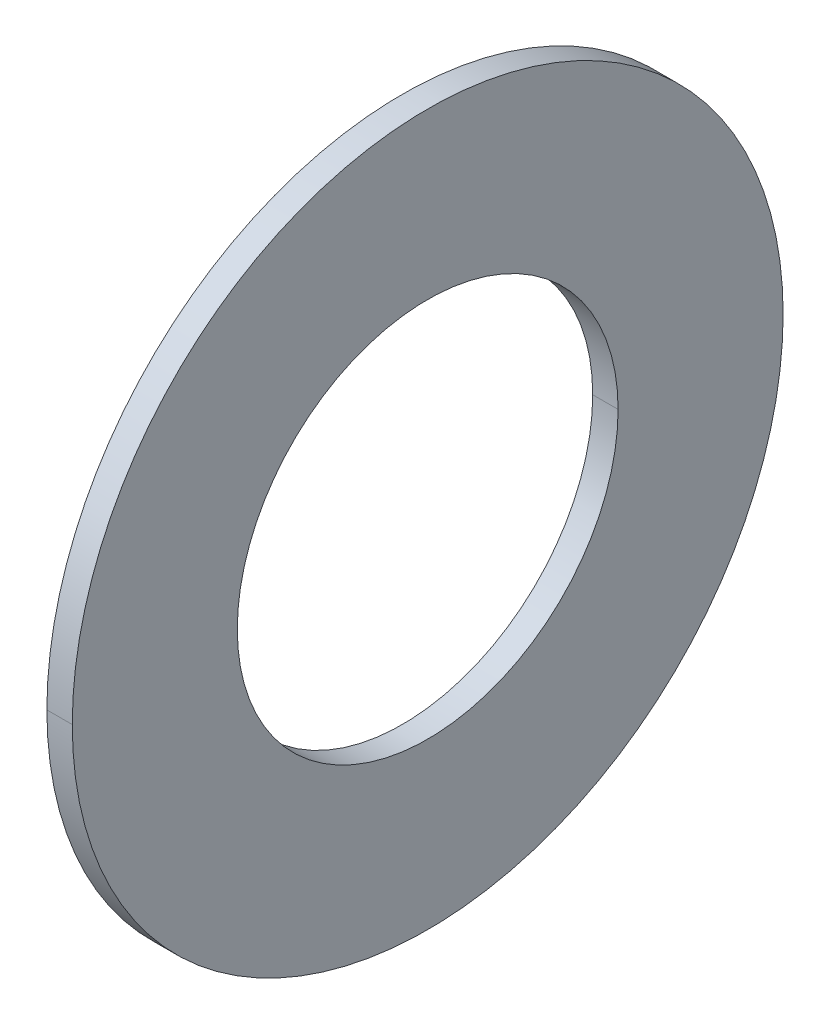
ISO-10303-21;
HEADER;
FILE_DESCRIPTION(('STEP AP214'),'2;1');
FILE_NAME('part.step','',(''),(''),'','','');
FILE_SCHEMA(('AUTOMOTIVE_DESIGN { 1 0 10303 214 1 1 1 1 }'));
ENDSEC;
DATA;
#1=APPLICATION_CONTEXT('core data for automotive mechanical design processes');
#2=APPLICATION_PROTOCOL_DEFINITION('international standard','automotive_design',2000,#1);
#3=PRODUCT_CONTEXT('',#1,'mechanical');
#4=PRODUCT('Part','Part','',(#3));
#5=PRODUCT_RELATED_PRODUCT_CATEGORY('part','',(#4));
#6=PRODUCT_DEFINITION_FORMATION('','',#4);
#7=PRODUCT_DEFINITION_CONTEXT('part definition',#1,'design');
#8=PRODUCT_DEFINITION('design','',#6,#7);
#9=PRODUCT_DEFINITION_SHAPE('','',#8);
#10=(LENGTH_UNIT() NAMED_UNIT(*) SI_UNIT(.MILLI.,.METRE.));
#11=(NAMED_UNIT(*) PLANE_ANGLE_UNIT() SI_UNIT($,.RADIAN.));
#12=(NAMED_UNIT(*) SI_UNIT($,.STERADIAN.) SOLID_ANGLE_UNIT());
#13=UNCERTAINTY_MEASURE_WITH_UNIT(LENGTH_MEASURE(1.E-05),#10,'distance_accuracy_value','');
#14=(GEOMETRIC_REPRESENTATION_CONTEXT(3) GLOBAL_UNCERTAINTY_ASSIGNED_CONTEXT((#13)) GLOBAL_UNIT_ASSIGNED_CONTEXT((#10,
#11,#12)) REPRESENTATION_CONTEXT('',''));
#15=CARTESIAN_POINT('',(0.,0.,0.));
#16=DIRECTION('',(0.,0.,1.));
#17=DIRECTION('',(1.,0.,0.));
#18=AXIS2_PLACEMENT_3D('',#15,#16,#17);
#19=CARTESIAN_POINT('',(1.,14.,0.));
#20=DIRECTION('',(-1.,0.,0.));
#21=DIRECTION('',(0.,0.,1.));
#22=AXIS2_PLACEMENT_3D('',#19,#20,#21);
#23=PLANE('',#22);
#24=CARTESIAN_POINT('',(1.,0.,0.));
#25=DIRECTION('',(1.,0.,0.));
#26=DIRECTION('',(0.,0.,-1.));
#27=AXIS2_PLACEMENT_3D('',#24,#25,#26);
#28=CIRCLE('',#27,7.5);
#29=CARTESIAN_POINT('',(1.,0.,-7.5));
#30=VERTEX_POINT('',#29);
#31=CARTESIAN_POINT('',(1.,0.,7.5));
#32=VERTEX_POINT('',#31);
#33=EDGE_CURVE('E11',#30,#32,#28,.T.);
#34=ORIENTED_EDGE('',*,*,#33,.T.);
#35=CARTESIAN_POINT('',(1.,0.,0.));
#36=DIRECTION('',(1.,0.,0.));
#37=DIRECTION('',(0.,0.,-1.));
#38=AXIS2_PLACEMENT_3D('',#35,#36,#37);
#39=CIRCLE('',#38,7.5);
#40=EDGE_CURVE('E24',#32,#30,#39,.T.);
#41=ORIENTED_EDGE('',*,*,#40,.T.);
#42=EDGE_LOOP('',(#34,#41));
#43=FACE_BOUND('',#42,.T.);
#44=CARTESIAN_POINT('',(1.,0.,0.));
#45=DIRECTION('',(1.,0.,0.));
#46=DIRECTION('',(0.,0.,-1.));
#47=AXIS2_PLACEMENT_3D('',#44,#45,#46);
#48=CIRCLE('',#47,14.);
#49=CARTESIAN_POINT('',(1.,0.,14.));
#50=VERTEX_POINT('',#49);
#51=CARTESIAN_POINT('',(1.,0.,-14.));
#52=VERTEX_POINT('',#51);
#53=EDGE_CURVE('E94',#50,#52,#48,.T.);
#54=ORIENTED_EDGE('',*,*,#53,.F.);
#55=CARTESIAN_POINT('',(1.,0.,0.));
#56=DIRECTION('',(1.,0.,0.));
#57=DIRECTION('',(0.,0.,-1.));
#58=AXIS2_PLACEMENT_3D('',#55,#56,#57);
#59=CIRCLE('',#58,14.);
#60=EDGE_CURVE('E89',#52,#50,#59,.T.);
#61=ORIENTED_EDGE('',*,*,#60,.F.);
#62=EDGE_LOOP('',(#54,#61));
#63=FACE_BOUND('',#62,.T.);
#64=ADVANCED_FACE('F16',(#43,#63),#23,.T.);
#65=CARTESIAN_POINT('',(50.,0.,0.));
#66=DIRECTION('',(1.,0.,0.));
#67=DIRECTION('',(0.,-1.,0.));
#68=AXIS2_PLACEMENT_3D('',#65,#66,#67);
#69=CYLINDRICAL_SURFACE('',#68,14.);
#70=DIRECTION('',(1.,0.,0.));
#71=VECTOR('',#70,1.);
#72=CARTESIAN_POINT('',(1.,0.,14.));
#73=LINE('',#72,#71);
#74=CARTESIAN_POINT('',(2.,0.,14.));
#75=VERTEX_POINT('',#74);
#76=EDGE_CURVE('E85',#50,#75,#73,.T.);
#77=ORIENTED_EDGE('',*,*,#76,.T.);
#78=CARTESIAN_POINT('',(2.,0.,0.));
#79=DIRECTION('',(1.,0.,0.));
#80=DIRECTION('',(0.,0.,-1.));
#81=AXIS2_PLACEMENT_3D('',#78,#79,#80);
#82=CIRCLE('',#81,14.);
#83=CARTESIAN_POINT('',(2.,0.,-14.));
#84=VERTEX_POINT('',#83);
#85=EDGE_CURVE('E80',#84,#75,#82,.T.);
#86=ORIENTED_EDGE('',*,*,#85,.F.);
#87=DIRECTION('',(1.,0.,0.));
#88=VECTOR('',#87,1.);
#89=CARTESIAN_POINT('',(1.,0.,-14.));
#90=LINE('',#89,#88);
#91=EDGE_CURVE('E69',#52,#84,#90,.T.);
#92=ORIENTED_EDGE('',*,*,#91,.F.);
#93=ORIENTED_EDGE('',*,*,#60,.T.);
#94=EDGE_LOOP('',(#77,#86,#92,#93));
#95=FACE_BOUND('',#94,.T.);
#96=ADVANCED_FACE('F110',(#95),#69,.T.);
#97=CARTESIAN_POINT('',(50.,0.,0.));
#98=DIRECTION('',(1.,0.,0.));
#99=DIRECTION('',(0.,1.,0.));
#100=AXIS2_PLACEMENT_3D('',#97,#98,#99);
#101=CYLINDRICAL_SURFACE('',#100,14.);
#102=ORIENTED_EDGE('',*,*,#76,.F.);
#103=ORIENTED_EDGE('',*,*,#53,.T.);
#104=ORIENTED_EDGE('',*,*,#91,.T.);
#105=CARTESIAN_POINT('',(2.,0.,0.));
#106=DIRECTION('',(1.,0.,0.));
#107=DIRECTION('',(0.,0.,-1.));
#108=AXIS2_PLACEMENT_3D('',#105,#106,#107);
#109=CIRCLE('',#108,14.);
#110=EDGE_CURVE('E66',#75,#84,#109,.T.);
#111=ORIENTED_EDGE('',*,*,#110,.F.);
#112=EDGE_LOOP('',(#102,#103,#104,#111));
#113=FACE_BOUND('',#112,.T.);
#114=ADVANCED_FACE('F105',(#113),#101,.T.);
#115=CARTESIAN_POINT('',(2.,7.5,0.));
#116=DIRECTION('',(1.,0.,0.));
#117=DIRECTION('',(0.,0.,-1.));
#118=AXIS2_PLACEMENT_3D('',#115,#116,#117);
#119=PLANE('',#118);
#120=ORIENTED_EDGE('',*,*,#85,.T.);
#121=ORIENTED_EDGE('',*,*,#110,.T.);
#122=EDGE_LOOP('',(#120,#121));
#123=FACE_BOUND('',#122,.T.);
#124=CARTESIAN_POINT('',(2.,0.,0.));
#125=DIRECTION('',(1.,0.,0.));
#126=DIRECTION('',(0.,0.,-1.));
#127=AXIS2_PLACEMENT_3D('',#124,#125,#126);
#128=CIRCLE('',#127,7.5);
#129=CARTESIAN_POINT('',(2.,0.,7.5));
#130=VERTEX_POINT('',#129);
#131=CARTESIAN_POINT('',(2.,0.,-7.5));
#132=VERTEX_POINT('',#131);
#133=EDGE_CURVE('E54',#130,#132,#128,.T.);
#134=ORIENTED_EDGE('',*,*,#133,.F.);
#135=CARTESIAN_POINT('',(2.,0.,0.));
#136=DIRECTION('',(1.,0.,0.));
#137=DIRECTION('',(0.,0.,-1.));
#138=AXIS2_PLACEMENT_3D('',#135,#136,#137);
#139=CIRCLE('',#138,7.5);
#140=EDGE_CURVE('E50',#132,#130,#139,.T.);
#141=ORIENTED_EDGE('',*,*,#140,.F.);
#142=EDGE_LOOP('',(#134,#141));
#143=FACE_BOUND('',#142,.T.);
#144=ADVANCED_FACE('F52',(#123,#143),#119,.T.);
#145=CARTESIAN_POINT('',(50.,0.,0.));
#146=DIRECTION('',(1.,0.,0.));
#147=DIRECTION('',(0.,-1.,0.));
#148=AXIS2_PLACEMENT_3D('',#145,#146,#147);
#149=CYLINDRICAL_SURFACE('',#148,7.5);
#150=DIRECTION('',(1.,0.,0.));
#151=VECTOR('',#150,1.);
#152=CARTESIAN_POINT('',(1.,0.,7.5));
#153=LINE('',#152,#151);
#154=EDGE_CURVE('E58',#32,#130,#153,.T.);
#155=ORIENTED_EDGE('',*,*,#154,.F.);
#156=ORIENTED_EDGE('',*,*,#33,.F.);
#157=DIRECTION('',(1.,0.,0.));
#158=VECTOR('',#157,1.);
#159=CARTESIAN_POINT('',(1.,0.,-7.5));
#160=LINE('',#159,#158);
#161=EDGE_CURVE('E61',#30,#132,#160,.T.);
#162=ORIENTED_EDGE('',*,*,#161,.T.);
#163=ORIENTED_EDGE('',*,*,#140,.T.);
#164=EDGE_LOOP('',(#155,#156,#162,#163));
#165=FACE_BOUND('',#164,.T.);
#166=ADVANCED_FACE('F62',(#165),#149,.F.);
#167=CARTESIAN_POINT('',(50.,0.,0.));
#168=DIRECTION('',(1.,0.,0.));
#169=DIRECTION('',(0.,1.,0.));
#170=AXIS2_PLACEMENT_3D('',#167,#168,#169);
#171=CYLINDRICAL_SURFACE('',#170,7.5);
#172=ORIENTED_EDGE('',*,*,#154,.T.);
#173=ORIENTED_EDGE('',*,*,#133,.T.);
#174=ORIENTED_EDGE('',*,*,#161,.F.);
#175=ORIENTED_EDGE('',*,*,#40,.F.);
#176=EDGE_LOOP('',(#172,#173,#174,#175));
#177=FACE_BOUND('',#176,.T.);
#178=ADVANCED_FACE('F65',(#177),#171,.F.);
#179=CLOSED_SHELL('',(#64,#96,#114,#144,#166,#178));
#180=MANIFOLD_SOLID_BREP('B1',#179);
#181=ADVANCED_BREP_SHAPE_REPRESENTATION('',(#18,#180),#14);
#182=SHAPE_DEFINITION_REPRESENTATION(#9,#181);
ENDSEC;
END-ISO-10303-21;
